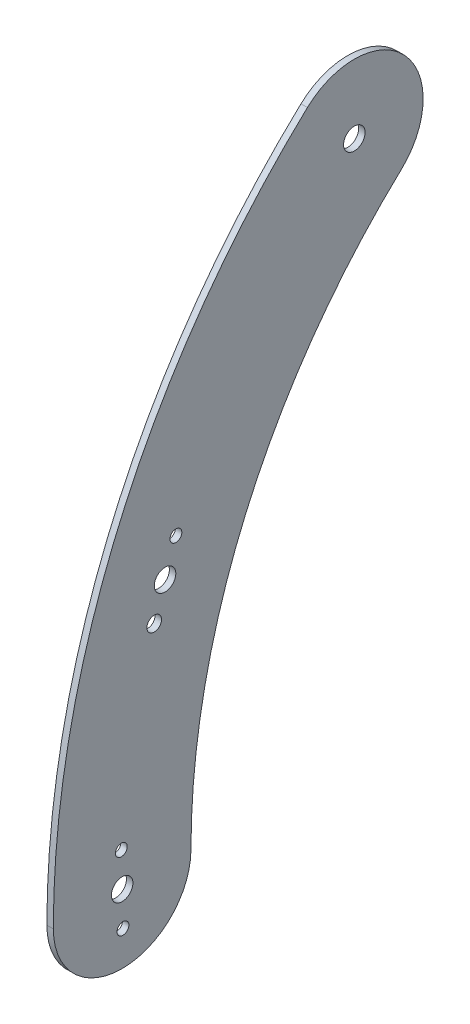
ISO-10303-21;
HEADER;
FILE_DESCRIPTION(('STEP AP214'),'2;1');
FILE_NAME('part.step','',(''),(''),'','','');
FILE_SCHEMA(('AUTOMOTIVE_DESIGN { 1 0 10303 214 1 1 1 1 }'));
ENDSEC;
DATA;
#1=APPLICATION_CONTEXT('core data for automotive mechanical design processes');
#2=APPLICATION_PROTOCOL_DEFINITION('international standard','automotive_design',2000,#1);
#3=PRODUCT_CONTEXT('',#1,'mechanical');
#4=PRODUCT('Part','Part','',(#3));
#5=PRODUCT_RELATED_PRODUCT_CATEGORY('part','',(#4));
#6=PRODUCT_DEFINITION_FORMATION('','',#4);
#7=PRODUCT_DEFINITION_CONTEXT('part definition',#1,'design');
#8=PRODUCT_DEFINITION('design','',#6,#7);
#9=PRODUCT_DEFINITION_SHAPE('','',#8);
#10=(LENGTH_UNIT() NAMED_UNIT(*) SI_UNIT(.MILLI.,.METRE.));
#11=(NAMED_UNIT(*) PLANE_ANGLE_UNIT() SI_UNIT($,.RADIAN.));
#12=(NAMED_UNIT(*) SI_UNIT($,.STERADIAN.) SOLID_ANGLE_UNIT());
#13=UNCERTAINTY_MEASURE_WITH_UNIT(LENGTH_MEASURE(1.E-05),#10,'distance_accuracy_value','');
#14=(GEOMETRIC_REPRESENTATION_CONTEXT(3) GLOBAL_UNCERTAINTY_ASSIGNED_CONTEXT((#13)) GLOBAL_UNIT_ASSIGNED_CONTEXT((#10,
#11,#12)) REPRESENTATION_CONTEXT('',''));
#15=CARTESIAN_POINT('',(0.,0.,0.));
#16=DIRECTION('',(0.,0.,1.));
#17=DIRECTION('',(1.,0.,0.));
#18=AXIS2_PLACEMENT_3D('',#15,#16,#17);
#19=CARTESIAN_POINT('',(-29.423102186696,93085.7893347694,177084.163049041));
#20=DIRECTION('',(1.,0.,0.));
#21=DIRECTION('',(0.,0.,-1.));
#22=AXIS2_PLACEMENT_3D('',#19,#20,#21);
#23=PLANE('',#22);
#24=CARTESIAN_POINT('',(-29.423102186696,93334.0839164691,177315.701492282));
#25=DIRECTION('',(1.,0.,0.));
#26=DIRECTION('',(0.,0.,-1.));
#27=AXIS2_PLACEMENT_3D('',#24,#25,#26);
#28=CIRCLE('',#27,5.00000000007682);
#29=CARTESIAN_POINT('',(-29.423102186696,93334.0839164691,177310.701492282));
#30=VERTEX_POINT('',#29);
#31=EDGE_CURVE('E92',#30,#30,#28,.T.);
#32=ORIENTED_EDGE('',*,*,#31,.T.);
#33=EDGE_LOOP('',(#32));
#34=FACE_BOUND('',#33,.T.);
#35=CARTESIAN_POINT('',(-29.423102186696,93215.6459086073,177398.661888834));
#36=DIRECTION('',(1.,0.,0.));
#37=DIRECTION('',(0.,0.,-1.));
#38=AXIS2_PLACEMENT_3D('',#35,#36,#37);
#39=CIRCLE('',#38,2.7500000000277);
#40=CARTESIAN_POINT('',(-29.423102186696,93215.6459086073,177395.911888834));
#41=VERTEX_POINT('',#40);
#42=EDGE_CURVE('E175',#41,#41,#39,.T.);
#43=ORIENTED_EDGE('',*,*,#42,.T.);
#44=EDGE_LOOP('',(#43));
#45=FACE_BOUND('',#44,.T.);
#46=CARTESIAN_POINT('',(-29.423102186696,93200.4630970052,177403.709881688));
#47=DIRECTION('',(1.,0.,0.));
#48=DIRECTION('',(0.,0.,-1.));
#49=AXIS2_PLACEMENT_3D('',#46,#47,#48);
#50=CIRCLE('',#49,4.99999999999113);
#51=CARTESIAN_POINT('',(-29.423102186696,93200.4630970052,177398.709881688));
#52=VERTEX_POINT('',#51);
#53=EDGE_CURVE('E173',#52,#52,#50,.T.);
#54=ORIENTED_EDGE('',*,*,#53,.T.);
#55=EDGE_LOOP('',(#54));
#56=FACE_BOUND('',#55,.T.);
#57=CARTESIAN_POINT('',(-29.423102186696,93185.280285403,177408.757874542));
#58=DIRECTION('',(1.,0.,0.));
#59=DIRECTION('',(0.,0.,-1.));
#60=AXIS2_PLACEMENT_3D('',#57,#58,#59);
#61=CIRCLE('',#60,3.40000000001182);
#62=CARTESIAN_POINT('',(-29.423102186696,93185.280285403,177405.357874542));
#63=VERTEX_POINT('',#62);
#64=EDGE_CURVE('E170',#63,#63,#61,.T.);
#65=ORIENTED_EDGE('',*,*,#64,.T.);
#66=EDGE_LOOP('',(#65));
#67=FACE_BOUND('',#66,.T.);
#68=CARTESIAN_POINT('',(-29.423102186696,93101.7848920314,177424.040074078));
#69=DIRECTION('',(1.,0.,0.));
#70=DIRECTION('',(0.,0.,-1.));
#71=AXIS2_PLACEMENT_3D('',#68,#69,#70);
#72=CIRCLE('',#71,2.74999999998806);
#73=CARTESIAN_POINT('',(-29.423102186696,93101.7848920314,177421.290074078));
#74=VERTEX_POINT('',#73);
#75=EDGE_CURVE('E167',#74,#74,#72,.T.);
#76=ORIENTED_EDGE('',*,*,#75,.T.);
#77=EDGE_LOOP('',(#76));
#78=FACE_BOUND('',#77,.T.);
#79=CARTESIAN_POINT('',(-29.423102186696,93085.7893347694,177423.663049041));
#80=DIRECTION('',(1.,0.,0.));
#81=DIRECTION('',(0.,0.,-1.));
#82=AXIS2_PLACEMENT_3D('',#79,#80,#81);
#83=CIRCLE('',#82,4.99999999997866);
#84=CARTESIAN_POINT('',(-29.423102186696,93085.7893347694,177418.663049041));
#85=VERTEX_POINT('',#84);
#86=EDGE_CURVE('E164',#85,#85,#83,.T.);
#87=ORIENTED_EDGE('',*,*,#86,.T.);
#88=EDGE_LOOP('',(#87));
#89=FACE_BOUND('',#88,.T.);
#90=CARTESIAN_POINT('',(-29.423102186696,93069.7937775074,177423.286024004));
#91=DIRECTION('',(1.,0.,0.));
#92=DIRECTION('',(0.,0.,-1.));
#93=AXIS2_PLACEMENT_3D('',#90,#91,#92);
#94=CIRCLE('',#93,2.74999999998806);
#95=CARTESIAN_POINT('',(-29.423102186696,93069.7937775074,177420.536024004));
#96=VERTEX_POINT('',#95);
#97=EDGE_CURVE('E155',#96,#96,#94,.T.);
#98=ORIENTED_EDGE('',*,*,#97,.T.);
#99=EDGE_LOOP('',(#98));
#100=FACE_BOUND('',#99,.T.);
#101=CARTESIAN_POINT('',(-29.423102186696,93334.0839164691,177315.701492282));
#102=DIRECTION('',(1.,0.,0.));
#103=DIRECTION('',(0.,0.,-1.));
#104=AXIS2_PLACEMENT_3D('',#101,#102,#103);
#105=CIRCLE('',#104,32.0000000000306);
#106=CARTESIAN_POINT('',(-29.423102186696,93310.6805980173,177293.87754476));
#107=VERTEX_POINT('',#106);
#108=CARTESIAN_POINT('',(-29.423102186696,93357.4872349209,177337.525439804));
#109=VERTEX_POINT('',#108);
#110=EDGE_CURVE('E97',#107,#109,#105,.T.);
#111=ORIENTED_EDGE('',*,*,#110,.F.);
#112=CARTESIAN_POINT('',(-29.423102186696,93085.7893347694,177084.163049041));
#113=DIRECTION('',(1.,0.,0.));
#114=DIRECTION('',(0.,0.,-1.));
#115=AXIS2_PLACEMENT_3D('',#112,#113,#114);
#116=CIRCLE('',#115,307.500000000005);
#117=CARTESIAN_POINT('',(-29.423102186696,93085.7893347694,177391.663049041));
#118=VERTEX_POINT('',#117);
#119=EDGE_CURVE('E12',#107,#118,#116,.T.);
#120=ORIENTED_EDGE('',*,*,#119,.T.);
#121=CARTESIAN_POINT('',(-29.423102186696,93085.7893347694,177423.663049041));
#122=DIRECTION('',(1.,0.,0.));
#123=DIRECTION('',(0.,0.,-1.));
#124=AXIS2_PLACEMENT_3D('',#121,#122,#123);
#125=CIRCLE('',#124,31.9999999999823);
#126=CARTESIAN_POINT('',(-29.423102186696,93085.7893347694,177455.663049041));
#127=VERTEX_POINT('',#126);
#128=EDGE_CURVE('E158',#127,#118,#125,.T.);
#129=ORIENTED_EDGE('',*,*,#128,.F.);
#130=CARTESIAN_POINT('',(-29.423102186696,93085.7893347694,177084.163049041));
#131=DIRECTION('',(1.,0.,0.));
#132=DIRECTION('',(0.,0.,-1.));
#133=AXIS2_PLACEMENT_3D('',#130,#131,#132);
#134=CIRCLE('',#133,371.500000000008);
#135=EDGE_CURVE('E137',#109,#127,#134,.T.);
#136=ORIENTED_EDGE('',*,*,#135,.F.);
#137=EDGE_LOOP('',(#111,#120,#129,#136));
#138=FACE_BOUND('',#137,.T.);
#139=ADVANCED_FACE('F88',(#34,#45,#56,#67,#78,#89,#100,#138),#23,.F.);
#140=CARTESIAN_POINT('',(-36.423102186696,93085.7893347694,177084.163049041));
#141=DIRECTION('',(1.,0.,0.));
#142=DIRECTION('',(0.,0.,-1.));
#143=AXIS2_PLACEMENT_3D('',#140,#141,#142);
#144=CYLINDRICAL_SURFACE('',#143,307.500000000005);
#145=DIRECTION('',(1.,0.,0.));
#146=VECTOR('',#145,1.);
#147=CARTESIAN_POINT('',(-36.423102186696,93310.6805980173,177293.87754476));
#148=LINE('',#147,#146);
#149=CARTESIAN_POINT('',(-26.423102186696,93310.6805980173,177293.87754476));
#150=VERTEX_POINT('',#149);
#151=EDGE_CURVE('E153',#107,#150,#148,.T.);
#152=ORIENTED_EDGE('',*,*,#151,.T.);
#153=CARTESIAN_POINT('',(-26.423102186696,93085.7893347694,177084.163049041));
#154=DIRECTION('',(1.,0.,0.));
#155=DIRECTION('',(0.,0.,-1.));
#156=AXIS2_PLACEMENT_3D('',#153,#154,#155);
#157=CIRCLE('',#156,307.500000000005);
#158=CARTESIAN_POINT('',(-26.423102186696,93085.7893347694,177391.663049041));
#159=VERTEX_POINT('',#158);
#160=EDGE_CURVE('E105',#150,#159,#157,.T.);
#161=ORIENTED_EDGE('',*,*,#160,.T.);
#162=DIRECTION('',(1.,0.,0.));
#163=VECTOR('',#162,1.);
#164=CARTESIAN_POINT('',(-36.423102186696,93085.7893347694,177391.663049041));
#165=LINE('',#164,#163);
#166=EDGE_CURVE('E140',#118,#159,#165,.T.);
#167=ORIENTED_EDGE('',*,*,#166,.F.);
#168=ORIENTED_EDGE('',*,*,#119,.F.);
#169=EDGE_LOOP('',(#152,#161,#167,#168));
#170=FACE_BOUND('',#169,.T.);
#171=ADVANCED_FACE('F200',(#170),#144,.F.);
#172=CARTESIAN_POINT('',(-36.423102186696,93334.0839164691,177315.701492282));
#173=DIRECTION('',(1.,0.,0.));
#174=DIRECTION('',(0.,0.,-1.));
#175=AXIS2_PLACEMENT_3D('',#172,#173,#174);
#176=CYLINDRICAL_SURFACE('',#175,32.0000000000306);
#177=ORIENTED_EDGE('',*,*,#110,.T.);
#178=DIRECTION('',(1.,0.,0.));
#179=VECTOR('',#178,1.);
#180=CARTESIAN_POINT('',(-36.423102186696,93357.4872349209,177337.525439804));
#181=LINE('',#180,#179);
#182=CARTESIAN_POINT('',(-26.423102186696,93357.4872349209,177337.525439804));
#183=VERTEX_POINT('',#182);
#184=EDGE_CURVE('E139',#109,#183,#181,.T.);
#185=ORIENTED_EDGE('',*,*,#184,.T.);
#186=CARTESIAN_POINT('',(-26.423102186696,93334.0839164691,177315.701492282));
#187=DIRECTION('',(1.,0.,0.));
#188=DIRECTION('',(0.,0.,-1.));
#189=AXIS2_PLACEMENT_3D('',#186,#187,#188);
#190=CIRCLE('',#189,32.0000000000306);
#191=EDGE_CURVE('E148',#150,#183,#190,.T.);
#192=ORIENTED_EDGE('',*,*,#191,.F.);
#193=ORIENTED_EDGE('',*,*,#151,.F.);
#194=EDGE_LOOP('',(#177,#185,#192,#193));
#195=FACE_BOUND('',#194,.T.);
#196=ADVANCED_FACE('F204',(#195),#176,.T.);
#197=CARTESIAN_POINT('',(-36.423102186696,93085.7893347694,177084.163049041));
#198=DIRECTION('',(1.,0.,0.));
#199=DIRECTION('',(0.,0.,-1.));
#200=AXIS2_PLACEMENT_3D('',#197,#198,#199);
#201=CYLINDRICAL_SURFACE('',#200,371.500000000008);
#202=ORIENTED_EDGE('',*,*,#135,.T.);
#203=DIRECTION('',(1.,0.,0.));
#204=VECTOR('',#203,1.);
#205=CARTESIAN_POINT('',(-36.423102186696,93085.7893347694,177455.663049041));
#206=LINE('',#205,#204);
#207=CARTESIAN_POINT('',(-26.423102186696,93085.7893347694,177455.663049041));
#208=VERTEX_POINT('',#207);
#209=EDGE_CURVE('E113',#127,#208,#206,.T.);
#210=ORIENTED_EDGE('',*,*,#209,.T.);
#211=CARTESIAN_POINT('',(-26.423102186696,93085.7893347694,177084.163049041));
#212=DIRECTION('',(1.,0.,0.));
#213=DIRECTION('',(0.,0.,-1.));
#214=AXIS2_PLACEMENT_3D('',#211,#212,#213);
#215=CIRCLE('',#214,371.500000000008);
#216=EDGE_CURVE('E134',#183,#208,#215,.T.);
#217=ORIENTED_EDGE('',*,*,#216,.F.);
#218=ORIENTED_EDGE('',*,*,#184,.F.);
#219=EDGE_LOOP('',(#202,#210,#217,#218));
#220=FACE_BOUND('',#219,.T.);
#221=ADVANCED_FACE('F131',(#220),#201,.T.);
#222=CARTESIAN_POINT('',(-36.423102186696,93085.7893347694,177423.663049041));
#223=DIRECTION('',(1.,0.,0.));
#224=DIRECTION('',(0.,0.,-1.));
#225=AXIS2_PLACEMENT_3D('',#222,#223,#224);
#226=CYLINDRICAL_SURFACE('',#225,31.9999999999823);
#227=ORIENTED_EDGE('',*,*,#128,.T.);
#228=ORIENTED_EDGE('',*,*,#166,.T.);
#229=CARTESIAN_POINT('',(-26.423102186696,93085.7893347694,177423.663049041));
#230=DIRECTION('',(1.,0.,0.));
#231=DIRECTION('',(0.,0.,-1.));
#232=AXIS2_PLACEMENT_3D('',#229,#230,#231);
#233=CIRCLE('',#232,31.9999999999823);
#234=EDGE_CURVE('E143',#208,#159,#233,.T.);
#235=ORIENTED_EDGE('',*,*,#234,.F.);
#236=ORIENTED_EDGE('',*,*,#209,.F.);
#237=EDGE_LOOP('',(#227,#228,#235,#236));
#238=FACE_BOUND('',#237,.T.);
#239=ADVANCED_FACE('F144',(#238),#226,.T.);
#240=CARTESIAN_POINT('',(-36.423102186696,93069.7937775074,177423.286024004));
#241=DIRECTION('',(1.,0.,0.));
#242=DIRECTION('',(0.,0.,-1.));
#243=AXIS2_PLACEMENT_3D('',#240,#241,#242);
#244=CYLINDRICAL_SURFACE('',#243,2.74999999998806);
#245=CARTESIAN_POINT('',(-26.423102186696,93069.7937775074,177423.286024004));
#246=DIRECTION('',(1.,0.,0.));
#247=DIRECTION('',(0.,0.,-1.));
#248=AXIS2_PLACEMENT_3D('',#245,#246,#247);
#249=CIRCLE('',#248,2.74999999998806);
#250=CARTESIAN_POINT('',(-26.423102186696,93069.7937775074,177420.536024004));
#251=VERTEX_POINT('',#250);
#252=EDGE_CURVE('E218',#251,#251,#249,.T.);
#253=ORIENTED_EDGE('',*,*,#252,.T.);
#254=EDGE_LOOP('',(#253));
#255=FACE_BOUND('',#254,.T.);
#256=ORIENTED_EDGE('',*,*,#97,.F.);
#257=EDGE_LOOP('',(#256));
#258=FACE_BOUND('',#257,.T.);
#259=ADVANCED_FACE('F209',(#255,#258),#244,.F.);
#260=CARTESIAN_POINT('',(-36.423102186696,93085.7893347694,177423.663049041));
#261=DIRECTION('',(1.,0.,0.));
#262=DIRECTION('',(0.,0.,-1.));
#263=AXIS2_PLACEMENT_3D('',#260,#261,#262);
#264=CYLINDRICAL_SURFACE('',#263,4.99999999997866);
#265=CARTESIAN_POINT('',(-26.423102186696,93085.7893347694,177423.663049041));
#266=DIRECTION('',(1.,0.,0.));
#267=DIRECTION('',(0.,0.,-1.));
#268=AXIS2_PLACEMENT_3D('',#265,#266,#267);
#269=CIRCLE('',#268,4.99999999997866);
#270=CARTESIAN_POINT('',(-26.423102186696,93085.7893347694,177418.663049041));
#271=VERTEX_POINT('',#270);
#272=EDGE_CURVE('E220',#271,#271,#269,.T.);
#273=ORIENTED_EDGE('',*,*,#272,.T.);
#274=EDGE_LOOP('',(#273));
#275=FACE_BOUND('',#274,.T.);
#276=ORIENTED_EDGE('',*,*,#86,.F.);
#277=EDGE_LOOP('',(#276));
#278=FACE_BOUND('',#277,.T.);
#279=ADVANCED_FACE('F240',(#275,#278),#264,.F.);
#280=CARTESIAN_POINT('',(-36.423102186696,93101.7848920314,177424.040074078));
#281=DIRECTION('',(1.,0.,0.));
#282=DIRECTION('',(0.,0.,-1.));
#283=AXIS2_PLACEMENT_3D('',#280,#281,#282);
#284=CYLINDRICAL_SURFACE('',#283,2.74999999998806);
#285=CARTESIAN_POINT('',(-26.423102186696,93101.7848920314,177424.040074078));
#286=DIRECTION('',(1.,0.,0.));
#287=DIRECTION('',(0.,0.,-1.));
#288=AXIS2_PLACEMENT_3D('',#285,#286,#287);
#289=CIRCLE('',#288,2.74999999998806);
#290=CARTESIAN_POINT('',(-26.423102186696,93101.7848920314,177421.290074078));
#291=VERTEX_POINT('',#290);
#292=EDGE_CURVE('E234',#291,#291,#289,.T.);
#293=ORIENTED_EDGE('',*,*,#292,.T.);
#294=EDGE_LOOP('',(#293));
#295=FACE_BOUND('',#294,.T.);
#296=ORIENTED_EDGE('',*,*,#75,.F.);
#297=EDGE_LOOP('',(#296));
#298=FACE_BOUND('',#297,.T.);
#299=ADVANCED_FACE('F254',(#295,#298),#284,.F.);
#300=CARTESIAN_POINT('',(-36.423102186696,93185.280285403,177408.757874542));
#301=DIRECTION('',(1.,0.,0.));
#302=DIRECTION('',(0.,0.,-1.));
#303=AXIS2_PLACEMENT_3D('',#300,#301,#302);
#304=CYLINDRICAL_SURFACE('',#303,3.40000000001182);
#305=CARTESIAN_POINT('',(-26.423102186696,93185.280285403,177408.757874542));
#306=DIRECTION('',(1.,0.,0.));
#307=DIRECTION('',(0.,0.,-1.));
#308=AXIS2_PLACEMENT_3D('',#305,#306,#307);
#309=CIRCLE('',#308,3.40000000001182);
#310=CARTESIAN_POINT('',(-26.423102186696,93185.280285403,177405.357874542));
#311=VERTEX_POINT('',#310);
#312=EDGE_CURVE('E231',#311,#311,#309,.T.);
#313=ORIENTED_EDGE('',*,*,#312,.T.);
#314=EDGE_LOOP('',(#313));
#315=FACE_BOUND('',#314,.T.);
#316=ORIENTED_EDGE('',*,*,#64,.F.);
#317=EDGE_LOOP('',(#316));
#318=FACE_BOUND('',#317,.T.);
#319=ADVANCED_FACE('F259',(#315,#318),#304,.F.);
#320=CARTESIAN_POINT('',(-36.423102186696,93200.4630970052,177403.709881688));
#321=DIRECTION('',(1.,0.,0.));
#322=DIRECTION('',(0.,0.,-1.));
#323=AXIS2_PLACEMENT_3D('',#320,#321,#322);
#324=CYLINDRICAL_SURFACE('',#323,4.99999999999113);
#325=CARTESIAN_POINT('',(-26.423102186696,93200.4630970052,177403.709881688));
#326=DIRECTION('',(1.,0.,0.));
#327=DIRECTION('',(0.,0.,-1.));
#328=AXIS2_PLACEMENT_3D('',#325,#326,#327);
#329=CIRCLE('',#328,4.99999999999113);
#330=CARTESIAN_POINT('',(-26.423102186696,93200.4630970052,177398.709881688));
#331=VERTEX_POINT('',#330);
#332=EDGE_CURVE('E228',#331,#331,#329,.T.);
#333=ORIENTED_EDGE('',*,*,#332,.T.);
#334=EDGE_LOOP('',(#333));
#335=FACE_BOUND('',#334,.T.);
#336=ORIENTED_EDGE('',*,*,#53,.F.);
#337=EDGE_LOOP('',(#336));
#338=FACE_BOUND('',#337,.T.);
#339=ADVANCED_FACE('F194',(#335,#338),#324,.F.);
#340=CARTESIAN_POINT('',(-36.423102186696,93215.6459086073,177398.661888834));
#341=DIRECTION('',(1.,0.,0.));
#342=DIRECTION('',(0.,0.,-1.));
#343=AXIS2_PLACEMENT_3D('',#340,#341,#342);
#344=CYLINDRICAL_SURFACE('',#343,2.7500000000277);
#345=CARTESIAN_POINT('',(-26.423102186696,93215.6459086073,177398.661888834));
#346=DIRECTION('',(1.,0.,0.));
#347=DIRECTION('',(0.,0.,-1.));
#348=AXIS2_PLACEMENT_3D('',#345,#346,#347);
#349=CIRCLE('',#348,2.7500000000277);
#350=CARTESIAN_POINT('',(-26.423102186696,93215.6459086073,177395.911888834));
#351=VERTEX_POINT('',#350);
#352=EDGE_CURVE('E225',#351,#351,#349,.T.);
#353=ORIENTED_EDGE('',*,*,#352,.T.);
#354=EDGE_LOOP('',(#353));
#355=FACE_BOUND('',#354,.T.);
#356=ORIENTED_EDGE('',*,*,#42,.F.);
#357=EDGE_LOOP('',(#356));
#358=FACE_BOUND('',#357,.T.);
#359=ADVANCED_FACE('F185',(#355,#358),#344,.F.);
#360=CARTESIAN_POINT('',(-36.423102186696,93334.0839164691,177315.701492282));
#361=DIRECTION('',(1.,0.,0.));
#362=DIRECTION('',(0.,0.,-1.));
#363=AXIS2_PLACEMENT_3D('',#360,#361,#362);
#364=CYLINDRICAL_SURFACE('',#363,5.00000000007682);
#365=CARTESIAN_POINT('',(-26.423102186696,93334.0839164691,177315.701492282));
#366=DIRECTION('',(1.,0.,0.));
#367=DIRECTION('',(0.,0.,-1.));
#368=AXIS2_PLACEMENT_3D('',#365,#366,#367);
#369=CIRCLE('',#368,5.00000000007682);
#370=CARTESIAN_POINT('',(-26.423102186696,93334.0839164691,177310.701492282));
#371=VERTEX_POINT('',#370);
#372=EDGE_CURVE('E223',#371,#371,#369,.T.);
#373=ORIENTED_EDGE('',*,*,#372,.T.);
#374=EDGE_LOOP('',(#373));
#375=FACE_BOUND('',#374,.T.);
#376=ORIENTED_EDGE('',*,*,#31,.F.);
#377=EDGE_LOOP('',(#376));
#378=FACE_BOUND('',#377,.T.);
#379=ADVANCED_FACE('F183',(#375,#378),#364,.F.);
#380=CARTESIAN_POINT('',(-26.423102186696,93085.7893347694,177084.163049041));
#381=DIRECTION('',(-1.,0.,0.));
#382=DIRECTION('',(0.,0.,1.));
#383=AXIS2_PLACEMENT_3D('',#380,#381,#382);
#384=PLANE('',#383);
#385=ORIENTED_EDGE('',*,*,#372,.F.);
#386=EDGE_LOOP('',(#385));
#387=FACE_BOUND('',#386,.T.);
#388=ORIENTED_EDGE('',*,*,#352,.F.);
#389=EDGE_LOOP('',(#388));
#390=FACE_BOUND('',#389,.T.);
#391=ORIENTED_EDGE('',*,*,#332,.F.);
#392=EDGE_LOOP('',(#391));
#393=FACE_BOUND('',#392,.T.);
#394=ORIENTED_EDGE('',*,*,#312,.F.);
#395=EDGE_LOOP('',(#394));
#396=FACE_BOUND('',#395,.T.);
#397=ORIENTED_EDGE('',*,*,#292,.F.);
#398=EDGE_LOOP('',(#397));
#399=FACE_BOUND('',#398,.T.);
#400=ORIENTED_EDGE('',*,*,#272,.F.);
#401=EDGE_LOOP('',(#400));
#402=FACE_BOUND('',#401,.T.);
#403=ORIENTED_EDGE('',*,*,#252,.F.);
#404=EDGE_LOOP('',(#403));
#405=FACE_BOUND('',#404,.T.);
#406=ORIENTED_EDGE('',*,*,#234,.T.);
#407=ORIENTED_EDGE('',*,*,#160,.F.);
#408=ORIENTED_EDGE('',*,*,#191,.T.);
#409=ORIENTED_EDGE('',*,*,#216,.T.);
#410=EDGE_LOOP('',(#406,#407,#408,#409));
#411=FACE_BOUND('',#410,.T.);
#412=ADVANCED_FACE('F90',(#387,#390,#393,#396,#399,#402,#405,#411),#384,.F.);
#413=CLOSED_SHELL('',(#139,#171,#196,#221,#239,#259,#279,#299,#319,#339,#359,#379,#412));
#414=MANIFOLD_SOLID_BREP('B2',#413);
#415=ADVANCED_BREP_SHAPE_REPRESENTATION('',(#18,#414),#14);
#416=SHAPE_DEFINITION_REPRESENTATION(#9,#415);
ENDSEC;
END-ISO-10303-21;
